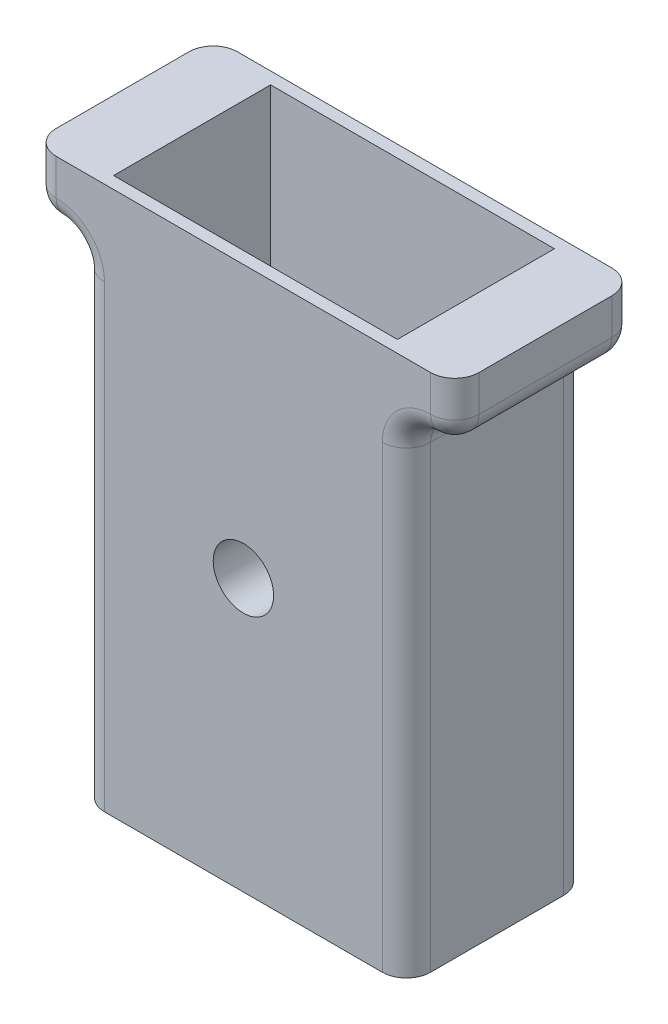
ISO-10303-21;
HEADER;
FILE_DESCRIPTION(('STEP AP214'),'2;1');
FILE_NAME('part.step','',(''),(''),'','','');
FILE_SCHEMA(('AUTOMOTIVE_DESIGN { 1 0 10303 214 1 1 1 1 }'));
ENDSEC;
DATA;
#1=APPLICATION_CONTEXT('core data for automotive mechanical design processes');
#2=APPLICATION_PROTOCOL_DEFINITION('international standard','automotive_design',2000,#1);
#3=PRODUCT_CONTEXT('',#1,'mechanical');
#4=PRODUCT('Part','Part','',(#3));
#5=PRODUCT_RELATED_PRODUCT_CATEGORY('part','',(#4));
#6=PRODUCT_DEFINITION_FORMATION('','',#4);
#7=PRODUCT_DEFINITION_CONTEXT('part definition',#1,'design');
#8=PRODUCT_DEFINITION('design','',#6,#7);
#9=PRODUCT_DEFINITION_SHAPE('','',#8);
#10=(LENGTH_UNIT() NAMED_UNIT(*) SI_UNIT(.MILLI.,.METRE.));
#11=(NAMED_UNIT(*) PLANE_ANGLE_UNIT() SI_UNIT($,.RADIAN.));
#12=(NAMED_UNIT(*) SI_UNIT($,.STERADIAN.) SOLID_ANGLE_UNIT());
#13=UNCERTAINTY_MEASURE_WITH_UNIT(LENGTH_MEASURE(1.E-05),#10,'distance_accuracy_value','');
#14=(GEOMETRIC_REPRESENTATION_CONTEXT(3) GLOBAL_UNCERTAINTY_ASSIGNED_CONTEXT((#13)) GLOBAL_UNIT_ASSIGNED_CONTEXT((#10,
#11,#12)) REPRESENTATION_CONTEXT('',''));
#15=CARTESIAN_POINT('',(0.,0.,0.));
#16=DIRECTION('',(0.,0.,1.));
#17=DIRECTION('',(1.,0.,0.));
#18=AXIS2_PLACEMENT_3D('',#15,#16,#17);
#19=CARTESIAN_POINT('',(13.5,22.5,2.));
#20=DIRECTION('',(0.,0.,-1.));
#21=DIRECTION('',(-1.,0.,0.));
#22=AXIS2_PLACEMENT_3D('',#19,#20,#21);
#23=CYLINDRICAL_SURFACE('',#22,2.5);
#24=CARTESIAN_POINT('',(13.5,22.5,0.));
#25=DIRECTION('',(0.,0.,-1.));
#26=DIRECTION('',(-1.,0.,0.));
#27=AXIS2_PLACEMENT_3D('',#24,#25,#26);
#28=CIRCLE('',#27,2.5);
#29=CARTESIAN_POINT('',(11.,22.5,0.));
#30=VERTEX_POINT('',#29);
#31=EDGE_CURVE('E178',#30,#30,#28,.T.);
#32=ORIENTED_EDGE('',*,*,#31,.F.);
#33=EDGE_LOOP('',(#32));
#34=FACE_BOUND('',#33,.T.);
#35=CARTESIAN_POINT('',(13.5,22.5,-10.));
#36=DIRECTION('',(0.,0.,-1.));
#37=DIRECTION('',(-1.,0.,0.));
#38=AXIS2_PLACEMENT_3D('',#35,#36,#37);
#39=CIRCLE('',#38,2.5);
#40=CARTESIAN_POINT('',(11.,22.5,-10.));
#41=VERTEX_POINT('',#40);
#42=EDGE_CURVE('E124',#41,#41,#39,.F.);
#43=ORIENTED_EDGE('',*,*,#42,.F.);
#44=EDGE_LOOP('',(#43));
#45=FACE_BOUND('',#44,.T.);
#46=ADVANCED_FACE('F37',(#34,#45),#23,.F.);
#47=CARTESIAN_POINT('',(0.,45.,0.));
#48=DIRECTION('',(1.,0.,0.));
#49=DIRECTION('',(0.,0.,-1.));
#50=AXIS2_PLACEMENT_3D('',#47,#48,#49);
#51=PLANE('',#50);
#52=DIRECTION('',(0.,0.,1.));
#53=VECTOR('',#52,1.);
#54=CARTESIAN_POINT('',(0.,28.,-11.75));
#55=LINE('',#54,#53);
#56=CARTESIAN_POINT('',(0.,28.,-11.75));
#57=VERTEX_POINT('',#56);
#58=CARTESIAN_POINT('',(0.,28.,-3.25));
#59=VERTEX_POINT('',#58);
#60=EDGE_CURVE('E457',#57,#59,#55,.T.);
#61=ORIENTED_EDGE('',*,*,#60,.F.);
#62=DIRECTION('',(0.,-1.,0.));
#63=VECTOR('',#62,1.);
#64=CARTESIAN_POINT('',(0.,31.5,-11.75));
#65=LINE('',#64,#63);
#66=CARTESIAN_POINT('',(0.,31.5,-11.75));
#67=VERTEX_POINT('',#66);
#68=EDGE_CURVE('E460',#67,#57,#65,.T.);
#69=ORIENTED_EDGE('',*,*,#68,.F.);
#70=DIRECTION('',(0.,0.,-1.));
#71=VECTOR('',#70,1.);
#72=CARTESIAN_POINT('',(0.,31.5,-11.75));
#73=LINE('',#72,#71);
#74=CARTESIAN_POINT('',(0.,31.5,-3.25));
#75=VERTEX_POINT('',#74);
#76=EDGE_CURVE('E444',#75,#67,#73,.T.);
#77=ORIENTED_EDGE('',*,*,#76,.F.);
#78=DIRECTION('',(0.,1.,0.));
#79=VECTOR('',#78,1.);
#80=CARTESIAN_POINT('',(0.,31.5,-3.25));
#81=LINE('',#80,#79);
#82=EDGE_CURVE('E454',#59,#75,#81,.T.);
#83=ORIENTED_EDGE('',*,*,#82,.F.);
#84=EDGE_LOOP('',(#61,#69,#77,#83));
#85=FACE_BOUND('',#84,.T.);
#86=DIRECTION('',(0.,0.,-1.));
#87=VECTOR('',#86,1.);
#88=CARTESIAN_POINT('',(0.,38.,0.));
#89=LINE('',#88,#87);
#90=CARTESIAN_POINT('',(0.,38.,-2.));
#91=VERTEX_POINT('',#90);
#92=CARTESIAN_POINT('',(0.,38.,-13.));
#93=VERTEX_POINT('',#92);
#94=EDGE_CURVE('E253',#91,#93,#89,.T.);
#95=ORIENTED_EDGE('',*,*,#94,.T.);
#96=DIRECTION('',(0.,-1.,0.));
#97=VECTOR('',#96,1.);
#98=CARTESIAN_POINT('',(0.,45.,-13.));
#99=LINE('',#98,#97);
#100=CARTESIAN_POINT('',(0.,0.,-13.));
#101=VERTEX_POINT('',#100);
#102=EDGE_CURVE('E256',#93,#101,#99,.T.);
#103=ORIENTED_EDGE('',*,*,#102,.T.);
#104=DIRECTION('',(0.,0.,1.));
#105=VECTOR('',#104,1.);
#106=CARTESIAN_POINT('',(0.,0.,0.));
#107=LINE('',#106,#105);
#108=CARTESIAN_POINT('',(0.,0.,-2.));
#109=VERTEX_POINT('',#108);
#110=EDGE_CURVE('E301',#101,#109,#107,.T.);
#111=ORIENTED_EDGE('',*,*,#110,.T.);
#112=DIRECTION('',(0.,-1.,0.));
#113=VECTOR('',#112,1.);
#114=CARTESIAN_POINT('',(0.,45.,-2.));
#115=LINE('',#114,#113);
#116=EDGE_CURVE('E250',#109,#91,#115,.F.);
#117=ORIENTED_EDGE('',*,*,#116,.T.);
#118=EDGE_LOOP('',(#95,#103,#111,#117));
#119=FACE_BOUND('',#118,.T.);
#120=ADVANCED_FACE('F487',(#85,#119),#51,.F.);
#121=CARTESIAN_POINT('',(0.,45.,0.));
#122=DIRECTION('',(0.,0.,-1.));
#123=DIRECTION('',(-1.,0.,0.));
#124=AXIS2_PLACEMENT_3D('',#121,#122,#123);
#125=PLANE('',#124);
#126=ORIENTED_EDGE('',*,*,#31,.T.);
#127=EDGE_LOOP('',(#126));
#128=FACE_BOUND('',#127,.T.);
#129=DIRECTION('',(1.,0.,0.));
#130=VECTOR('',#129,1.);
#131=CARTESIAN_POINT('',(0.,45.,0.));
#132=LINE('',#131,#130);
#133=CARTESIAN_POINT('',(-2.00000000000001,45.,0.));
#134=VERTEX_POINT('',#133);
#135=CARTESIAN_POINT('',(29.,45.,0.));
#136=VERTEX_POINT('',#135);
#137=EDGE_CURVE('E323',#134,#136,#132,.T.);
#138=ORIENTED_EDGE('',*,*,#137,.F.);
#139=DIRECTION('',(0.,1.,0.));
#140=VECTOR('',#139,1.);
#141=CARTESIAN_POINT('',(-2.00000000000001,40.,0.));
#142=LINE('',#141,#140);
#143=CARTESIAN_POINT('',(-2.,42.,0.));
#144=VERTEX_POINT('',#143);
#145=EDGE_CURVE('E217',#134,#144,#142,.F.);
#146=ORIENTED_EDGE('',*,*,#145,.T.);
#147=CARTESIAN_POINT('',(-2.,38.,0.));
#148=DIRECTION('',(0.,0.,-1.));
#149=DIRECTION('',(-1.,0.,0.));
#150=AXIS2_PLACEMENT_3D('',#147,#148,#149);
#151=CIRCLE('',#150,4.);
#152=CARTESIAN_POINT('',(2.,38.,0.));
#153=VERTEX_POINT('',#152);
#154=EDGE_CURVE('E314',#153,#144,#151,.F.);
#155=ORIENTED_EDGE('',*,*,#154,.F.);
#156=DIRECTION('',(0.,-1.,0.));
#157=VECTOR('',#156,1.);
#158=CARTESIAN_POINT('',(2.,45.,0.));
#159=LINE('',#158,#157);
#160=CARTESIAN_POINT('',(2.,0.,0.));
#161=VERTEX_POINT('',#160);
#162=EDGE_CURVE('E300',#153,#161,#159,.T.);
#163=ORIENTED_EDGE('',*,*,#162,.T.);
#164=DIRECTION('',(1.,0.,0.));
#165=VECTOR('',#164,1.);
#166=CARTESIAN_POINT('',(0.,0.,0.));
#167=LINE('',#166,#165);
#168=CARTESIAN_POINT('',(25.,0.,0.));
#169=VERTEX_POINT('',#168);
#170=EDGE_CURVE('E281',#161,#169,#167,.T.);
#171=ORIENTED_EDGE('',*,*,#170,.T.);
#172=DIRECTION('',(0.,-1.,0.));
#173=VECTOR('',#172,1.);
#174=CARTESIAN_POINT('',(25.,45.,0.));
#175=LINE('',#174,#173);
#176=CARTESIAN_POINT('',(25.,38.,0.));
#177=VERTEX_POINT('',#176);
#178=EDGE_CURVE('E297',#169,#177,#175,.F.);
#179=ORIENTED_EDGE('',*,*,#178,.T.);
#180=CARTESIAN_POINT('',(29.,38.,0.));
#181=DIRECTION('',(0.,0.,-1.));
#182=DIRECTION('',(-1.,0.,0.));
#183=AXIS2_PLACEMENT_3D('',#180,#181,#182);
#184=CIRCLE('',#183,4.);
#185=CARTESIAN_POINT('',(29.,42.,0.));
#186=VERTEX_POINT('',#185);
#187=EDGE_CURVE('E305',#186,#177,#184,.F.);
#188=ORIENTED_EDGE('',*,*,#187,.F.);
#189=DIRECTION('',(0.,1.,0.));
#190=VECTOR('',#189,1.);
#191=CARTESIAN_POINT('',(29.,45.,0.));
#192=LINE('',#191,#190);
#193=EDGE_CURVE('E304',#186,#136,#192,.T.);
#194=ORIENTED_EDGE('',*,*,#193,.T.);
#195=EDGE_LOOP('',(#138,#146,#155,#163,#171,#179,#188,#194));
#196=FACE_BOUND('',#195,.T.);
#197=ADVANCED_FACE('F294',(#128,#196),#125,.F.);
#198=CARTESIAN_POINT('',(27.,45.,0.));
#199=DIRECTION('',(-1.,0.,0.));
#200=DIRECTION('',(0.,0.,1.));
#201=AXIS2_PLACEMENT_3D('',#198,#199,#200);
#202=PLANE('',#201);
#203=DIRECTION('',(0.,0.,1.));
#204=VECTOR('',#203,1.);
#205=CARTESIAN_POINT('',(27.,38.,0.));
#206=LINE('',#205,#204);
#207=CARTESIAN_POINT('',(27.,38.,-13.));
#208=VERTEX_POINT('',#207);
#209=CARTESIAN_POINT('',(27.,38.,-2.));
#210=VERTEX_POINT('',#209);
#211=EDGE_CURVE('E262',#208,#210,#206,.T.);
#212=ORIENTED_EDGE('',*,*,#211,.T.);
#213=DIRECTION('',(0.,-1.,0.));
#214=VECTOR('',#213,1.);
#215=CARTESIAN_POINT('',(27.,45.,-2.));
#216=LINE('',#215,#214);
#217=CARTESIAN_POINT('',(27.,0.,-2.));
#218=VERTEX_POINT('',#217);
#219=EDGE_CURVE('E265',#210,#218,#216,.T.);
#220=ORIENTED_EDGE('',*,*,#219,.T.);
#221=DIRECTION('',(0.,0.,-1.));
#222=VECTOR('',#221,1.);
#223=CARTESIAN_POINT('',(27.,0.,0.));
#224=LINE('',#223,#222);
#225=CARTESIAN_POINT('',(27.,0.,-13.));
#226=VERTEX_POINT('',#225);
#227=EDGE_CURVE('E285',#218,#226,#224,.T.);
#228=ORIENTED_EDGE('',*,*,#227,.T.);
#229=DIRECTION('',(0.,-1.,0.));
#230=VECTOR('',#229,1.);
#231=CARTESIAN_POINT('',(27.,45.,-13.));
#232=LINE('',#231,#230);
#233=EDGE_CURVE('E259',#226,#208,#232,.F.);
#234=ORIENTED_EDGE('',*,*,#233,.T.);
#235=EDGE_LOOP('',(#212,#220,#228,#234));
#236=FACE_BOUND('',#235,.T.);
#237=ADVANCED_FACE('F360',(#236),#202,.F.);
#238=CARTESIAN_POINT('',(0.,45.,-15.));
#239=DIRECTION('',(0.,0.,1.));
#240=DIRECTION('',(1.,0.,0.));
#241=AXIS2_PLACEMENT_3D('',#238,#239,#240);
#242=PLANE('',#241);
#243=CARTESIAN_POINT('',(13.5,22.5,-15.));
#244=DIRECTION('',(0.,0.,-1.));
#245=DIRECTION('',(-1.,0.,0.));
#246=AXIS2_PLACEMENT_3D('',#243,#244,#245);
#247=CIRCLE('',#246,5.75);
#248=CARTESIAN_POINT('',(7.74999999999999,22.5,-15.));
#249=VERTEX_POINT('',#248);
#250=EDGE_CURVE('E468',#249,#249,#247,.T.);
#251=ORIENTED_EDGE('',*,*,#250,.F.);
#252=EDGE_LOOP('',(#251));
#253=FACE_BOUND('',#252,.T.);
#254=CARTESIAN_POINT('',(-2.00000000000001,38.,-15.));
#255=DIRECTION('',(0.,0.,1.));
#256=DIRECTION('',(1.,0.,0.));
#257=AXIS2_PLACEMENT_3D('',#254,#255,#256);
#258=CIRCLE('',#257,4.);
#259=CARTESIAN_POINT('',(-2.00000000000001,42.,-15.));
#260=VERTEX_POINT('',#259);
#261=CARTESIAN_POINT('',(1.99999999999999,38.,-15.));
#262=VERTEX_POINT('',#261);
#263=EDGE_CURVE('E215',#260,#262,#258,.F.);
#264=ORIENTED_EDGE('',*,*,#263,.F.);
#265=DIRECTION('',(0.,1.,0.));
#266=VECTOR('',#265,1.);
#267=CARTESIAN_POINT('',(-2.00000000000001,45.,-15.));
#268=LINE('',#267,#266);
#269=CARTESIAN_POINT('',(-2.00000000000001,45.,-15.));
#270=VERTEX_POINT('',#269);
#271=EDGE_CURVE('E226',#260,#270,#268,.T.);
#272=ORIENTED_EDGE('',*,*,#271,.T.);
#273=DIRECTION('',(-1.,0.,0.));
#274=VECTOR('',#273,1.);
#275=CARTESIAN_POINT('',(0.,45.,-15.));
#276=LINE('',#275,#274);
#277=CARTESIAN_POINT('',(29.,45.,-15.));
#278=VERTEX_POINT('',#277);
#279=EDGE_CURVE('E374',#278,#270,#276,.T.);
#280=ORIENTED_EDGE('',*,*,#279,.F.);
#281=DIRECTION('',(0.,1.,0.));
#282=VECTOR('',#281,1.);
#283=CARTESIAN_POINT('',(29.,40.,-15.));
#284=LINE('',#283,#282);
#285=CARTESIAN_POINT('',(29.,42.,-15.));
#286=VERTEX_POINT('',#285);
#287=EDGE_CURVE('E199',#278,#286,#284,.F.);
#288=ORIENTED_EDGE('',*,*,#287,.T.);
#289=CARTESIAN_POINT('',(29.,38.,-15.));
#290=DIRECTION('',(0.,0.,1.));
#291=DIRECTION('',(1.,0.,0.));
#292=AXIS2_PLACEMENT_3D('',#289,#290,#291);
#293=CIRCLE('',#292,4.);
#294=CARTESIAN_POINT('',(25.,38.,-15.));
#295=VERTEX_POINT('',#294);
#296=EDGE_CURVE('E207',#295,#286,#293,.F.);
#297=ORIENTED_EDGE('',*,*,#296,.F.);
#298=DIRECTION('',(0.,-1.,0.));
#299=VECTOR('',#298,1.);
#300=CARTESIAN_POINT('',(25.,45.,-15.));
#301=LINE('',#300,#299);
#302=CARTESIAN_POINT('',(25.,0.,-15.));
#303=VERTEX_POINT('',#302);
#304=EDGE_CURVE('E213',#295,#303,#301,.T.);
#305=ORIENTED_EDGE('',*,*,#304,.T.);
#306=DIRECTION('',(-1.,0.,0.));
#307=VECTOR('',#306,1.);
#308=CARTESIAN_POINT('',(0.,0.,-15.));
#309=LINE('',#308,#307);
#310=CARTESIAN_POINT('',(1.99999999999999,0.,-15.));
#311=VERTEX_POINT('',#310);
#312=EDGE_CURVE('E369',#303,#311,#309,.T.);
#313=ORIENTED_EDGE('',*,*,#312,.T.);
#314=DIRECTION('',(0.,-1.,0.));
#315=VECTOR('',#314,1.);
#316=CARTESIAN_POINT('',(1.99999999999999,45.,-15.));
#317=LINE('',#316,#315);
#318=EDGE_CURVE('E223',#311,#262,#317,.F.);
#319=ORIENTED_EDGE('',*,*,#318,.T.);
#320=EDGE_LOOP('',(#264,#272,#280,#288,#297,#305,#313,#319));
#321=FACE_BOUND('',#320,.T.);
#322=ADVANCED_FACE('F368',(#253,#321),#242,.F.);
#323=CARTESIAN_POINT('',(0.,45.,0.));
#324=DIRECTION('',(0.,-1.,0.));
#325=DIRECTION('',(0.,0.,-1.));
#326=AXIS2_PLACEMENT_3D('',#323,#324,#325);
#327=PLANE('',#326);
#328=DIRECTION('',(1.,0.,0.));
#329=VECTOR('',#328,1.);
#330=CARTESIAN_POINT('',(1.74999999999999,45.,-1.));
#331=LINE('',#330,#329);
#332=CARTESIAN_POINT('',(1.74999999999999,45.,-1.));
#333=VERTEX_POINT('',#332);
#334=CARTESIAN_POINT('',(25.25,45.,-0.999999999999996));
#335=VERTEX_POINT('',#334);
#336=EDGE_CURVE('E417',#333,#335,#331,.T.);
#337=ORIENTED_EDGE('',*,*,#336,.F.);
#338=DIRECTION('',(0.,0.,1.));
#339=VECTOR('',#338,1.);
#340=CARTESIAN_POINT('',(1.74999999999999,45.,-14.));
#341=LINE('',#340,#339);
#342=CARTESIAN_POINT('',(1.74999999999999,45.,-14.));
#343=VERTEX_POINT('',#342);
#344=EDGE_CURVE('E420',#343,#333,#341,.T.);
#345=ORIENTED_EDGE('',*,*,#344,.F.);
#346=DIRECTION('',(-1.,0.,0.));
#347=VECTOR('',#346,1.);
#348=CARTESIAN_POINT('',(1.74999999999999,45.,-14.));
#349=LINE('',#348,#347);
#350=CARTESIAN_POINT('',(25.25,45.,-14.));
#351=VERTEX_POINT('',#350);
#352=EDGE_CURVE('E410',#351,#343,#349,.T.);
#353=ORIENTED_EDGE('',*,*,#352,.F.);
#354=DIRECTION('',(0.,0.,-1.));
#355=VECTOR('',#354,1.);
#356=CARTESIAN_POINT('',(25.25,45.,-14.));
#357=LINE('',#356,#355);
#358=EDGE_CURVE('E414',#335,#351,#357,.T.);
#359=ORIENTED_EDGE('',*,*,#358,.F.);
#360=EDGE_LOOP('',(#337,#345,#353,#359));
#361=FACE_BOUND('',#360,.T.);
#362=ORIENTED_EDGE('',*,*,#279,.T.);
#363=CARTESIAN_POINT('',(-2.00000000000001,45.,-13.));
#364=DIRECTION('',(0.,-1.,0.));
#365=DIRECTION('',(0.,0.,-1.));
#366=AXIS2_PLACEMENT_3D('',#363,#364,#365);
#367=CIRCLE('',#366,2.);
#368=CARTESIAN_POINT('',(-4.00000000000001,45.,-13.));
#369=VERTEX_POINT('',#368);
#370=EDGE_CURVE('E238',#270,#369,#367,.F.);
#371=ORIENTED_EDGE('',*,*,#370,.T.);
#372=DIRECTION('',(0.,0.,1.));
#373=VECTOR('',#372,1.);
#374=CARTESIAN_POINT('',(-4.00000000000001,45.,0.));
#375=LINE('',#374,#373);
#376=CARTESIAN_POINT('',(-4.00000000000001,45.,-2.));
#377=VERTEX_POINT('',#376);
#378=EDGE_CURVE('E392',#369,#377,#375,.T.);
#379=ORIENTED_EDGE('',*,*,#378,.T.);
#380=CARTESIAN_POINT('',(-2.00000000000001,45.,-2.));
#381=DIRECTION('',(0.,-1.,0.));
#382=DIRECTION('',(0.,0.,-1.));
#383=AXIS2_PLACEMENT_3D('',#380,#381,#382);
#384=CIRCLE('',#383,2.);
#385=EDGE_CURVE('E235',#377,#134,#384,.F.);
#386=ORIENTED_EDGE('',*,*,#385,.T.);
#387=ORIENTED_EDGE('',*,*,#137,.T.);
#388=CARTESIAN_POINT('',(29.,45.,-2.));
#389=DIRECTION('',(0.,-1.,0.));
#390=DIRECTION('',(0.,0.,-1.));
#391=AXIS2_PLACEMENT_3D('',#388,#389,#390);
#392=CIRCLE('',#391,2.);
#393=CARTESIAN_POINT('',(31.,45.,-2.));
#394=VERTEX_POINT('',#393);
#395=EDGE_CURVE('E232',#136,#394,#392,.F.);
#396=ORIENTED_EDGE('',*,*,#395,.T.);
#397=DIRECTION('',(0.,0.,-1.));
#398=VECTOR('',#397,1.);
#399=CARTESIAN_POINT('',(31.,45.,0.));
#400=LINE('',#399,#398);
#401=CARTESIAN_POINT('',(31.,45.,-13.));
#402=VERTEX_POINT('',#401);
#403=EDGE_CURVE('E390',#394,#402,#400,.T.);
#404=ORIENTED_EDGE('',*,*,#403,.T.);
#405=CARTESIAN_POINT('',(29.,45.,-13.));
#406=DIRECTION('',(0.,-1.,0.));
#407=DIRECTION('',(0.,0.,-1.));
#408=AXIS2_PLACEMENT_3D('',#405,#406,#407);
#409=CIRCLE('',#408,2.);
#410=EDGE_CURVE('E229',#402,#278,#409,.F.);
#411=ORIENTED_EDGE('',*,*,#410,.T.);
#412=EDGE_LOOP('',(#362,#371,#379,#386,#387,#396,#404,#411));
#413=FACE_BOUND('',#412,.T.);
#414=ADVANCED_FACE('F476',(#361,#413),#327,.F.);
#415=CARTESIAN_POINT('',(0.,0.,0.));
#416=DIRECTION('',(0.,-1.,0.));
#417=DIRECTION('',(0.,0.,-1.));
#418=AXIS2_PLACEMENT_3D('',#415,#416,#417);
#419=PLANE('',#418);
#420=ORIENTED_EDGE('',*,*,#110,.F.);
#421=CARTESIAN_POINT('',(1.99999999999999,0.,-13.));
#422=DIRECTION('',(0.,-1.,0.));
#423=DIRECTION('',(0.,0.,-1.));
#424=AXIS2_PLACEMENT_3D('',#421,#422,#423);
#425=CIRCLE('',#424,2.);
#426=EDGE_CURVE('E127',#101,#311,#425,.T.);
#427=ORIENTED_EDGE('',*,*,#426,.T.);
#428=ORIENTED_EDGE('',*,*,#312,.F.);
#429=CARTESIAN_POINT('',(25.,0.,-13.));
#430=DIRECTION('',(0.,-1.,0.));
#431=DIRECTION('',(0.,0.,-1.));
#432=AXIS2_PLACEMENT_3D('',#429,#430,#431);
#433=CIRCLE('',#432,2.);
#434=EDGE_CURVE('E271',#303,#226,#433,.T.);
#435=ORIENTED_EDGE('',*,*,#434,.T.);
#436=ORIENTED_EDGE('',*,*,#227,.F.);
#437=CARTESIAN_POINT('',(25.,0.,-2.));
#438=DIRECTION('',(0.,-1.,0.));
#439=DIRECTION('',(0.,0.,-1.));
#440=AXIS2_PLACEMENT_3D('',#437,#438,#439);
#441=CIRCLE('',#440,2.);
#442=EDGE_CURVE('E142',#218,#169,#441,.T.);
#443=ORIENTED_EDGE('',*,*,#442,.T.);
#444=ORIENTED_EDGE('',*,*,#170,.F.);
#445=CARTESIAN_POINT('',(2.,0.,-2.));
#446=DIRECTION('',(0.,-1.,0.));
#447=DIRECTION('',(0.,0.,-1.));
#448=AXIS2_PLACEMENT_3D('',#445,#446,#447);
#449=CIRCLE('',#448,2.);
#450=EDGE_CURVE('E133',#161,#109,#449,.T.);
#451=ORIENTED_EDGE('',*,*,#450,.T.);
#452=EDGE_LOOP('',(#420,#427,#428,#435,#436,#443,#444,#451));
#453=FACE_BOUND('',#452,.T.);
#454=ADVANCED_FACE('F279',(#453),#419,.T.);
#455=CARTESIAN_POINT('',(31.,40.,0.));
#456=DIRECTION('',(1.,0.,0.));
#457=DIRECTION('',(0.,0.,-1.));
#458=AXIS2_PLACEMENT_3D('',#455,#456,#457);
#459=PLANE('',#458);
#460=ORIENTED_EDGE('',*,*,#403,.F.);
#461=DIRECTION('',(0.,1.,0.));
#462=VECTOR('',#461,1.);
#463=CARTESIAN_POINT('',(31.,40.,-2.));
#464=LINE('',#463,#462);
#465=CARTESIAN_POINT('',(31.,42.,-2.));
#466=VERTEX_POINT('',#465);
#467=EDGE_CURVE('E60',#394,#466,#464,.F.);
#468=ORIENTED_EDGE('',*,*,#467,.T.);
#469=DIRECTION('',(0.,0.,-1.));
#470=VECTOR('',#469,1.);
#471=CARTESIAN_POINT('',(31.,42.,0.));
#472=LINE('',#471,#470);
#473=CARTESIAN_POINT('',(31.,42.,-13.));
#474=VERTEX_POINT('',#473);
#475=EDGE_CURVE('E100',#466,#474,#472,.T.);
#476=ORIENTED_EDGE('',*,*,#475,.T.);
#477=DIRECTION('',(0.,1.,0.));
#478=VECTOR('',#477,1.);
#479=CARTESIAN_POINT('',(31.,45.,-13.));
#480=LINE('',#479,#478);
#481=EDGE_CURVE('E201',#474,#402,#480,.T.);
#482=ORIENTED_EDGE('',*,*,#481,.T.);
#483=EDGE_LOOP('',(#460,#468,#476,#482));
#484=FACE_BOUND('',#483,.T.);
#485=ADVANCED_FACE('F533',(#484),#459,.T.);
#486=CARTESIAN_POINT('',(-4.00000000000001,40.,0.));
#487=DIRECTION('',(-1.,0.,0.));
#488=DIRECTION('',(0.,0.,1.));
#489=AXIS2_PLACEMENT_3D('',#486,#487,#488);
#490=PLANE('',#489);
#491=ORIENTED_EDGE('',*,*,#378,.F.);
#492=DIRECTION('',(0.,1.,0.));
#493=VECTOR('',#492,1.);
#494=CARTESIAN_POINT('',(-4.00000000000001,40.,-13.));
#495=LINE('',#494,#493);
#496=CARTESIAN_POINT('',(-4.00000000000001,42.,-13.));
#497=VERTEX_POINT('',#496);
#498=EDGE_CURVE('E247',#369,#497,#495,.F.);
#499=ORIENTED_EDGE('',*,*,#498,.T.);
#500=DIRECTION('',(0.,0.,1.));
#501=VECTOR('',#500,1.);
#502=CARTESIAN_POINT('',(-4.00000000000001,42.,0.));
#503=LINE('',#502,#501);
#504=CARTESIAN_POINT('',(-4.00000000000001,42.,-2.));
#505=VERTEX_POINT('',#504);
#506=EDGE_CURVE('E241',#497,#505,#503,.T.);
#507=ORIENTED_EDGE('',*,*,#506,.T.);
#508=DIRECTION('',(0.,1.,0.));
#509=VECTOR('',#508,1.);
#510=CARTESIAN_POINT('',(-4.00000000000001,45.,-2.));
#511=LINE('',#510,#509);
#512=EDGE_CURVE('E244',#505,#377,#511,.T.);
#513=ORIENTED_EDGE('',*,*,#512,.T.);
#514=EDGE_LOOP('',(#491,#499,#507,#513));
#515=FACE_BOUND('',#514,.T.);
#516=ADVANCED_FACE('F532',(#515),#490,.T.);
#517=CARTESIAN_POINT('',(1.74999999999999,28.,-14.));
#518=DIRECTION('',(-1.,0.,0.));
#519=DIRECTION('',(0.,0.,1.));
#520=AXIS2_PLACEMENT_3D('',#517,#518,#519);
#521=PLANE('',#520);
#522=DIRECTION('',(0.,0.,-1.));
#523=VECTOR('',#522,1.);
#524=CARTESIAN_POINT('',(1.74999999999999,31.5,-14.));
#525=LINE('',#524,#523);
#526=CARTESIAN_POINT('',(1.74999999999999,31.5,-3.25));
#527=VERTEX_POINT('',#526);
#528=CARTESIAN_POINT('',(1.74999999999999,31.5,-11.75));
#529=VERTEX_POINT('',#528);
#530=EDGE_CURVE('E309',#527,#529,#525,.T.);
#531=ORIENTED_EDGE('',*,*,#530,.T.);
#532=DIRECTION('',(0.,-1.,0.));
#533=VECTOR('',#532,1.);
#534=CARTESIAN_POINT('',(1.74999999999999,28.,-11.75));
#535=LINE('',#534,#533);
#536=CARTESIAN_POINT('',(1.74999999999999,28.,-11.75));
#537=VERTEX_POINT('',#536);
#538=EDGE_CURVE('E423',#529,#537,#535,.T.);
#539=ORIENTED_EDGE('',*,*,#538,.T.);
#540=DIRECTION('',(0.,0.,1.));
#541=VECTOR('',#540,1.);
#542=CARTESIAN_POINT('',(1.74999999999999,28.,-14.));
#543=LINE('',#542,#541);
#544=CARTESIAN_POINT('',(1.74999999999999,28.,-14.));
#545=VERTEX_POINT('',#544);
#546=EDGE_CURVE('E433',#545,#537,#543,.T.);
#547=ORIENTED_EDGE('',*,*,#546,.F.);
#548=DIRECTION('',(0.,1.,0.));
#549=VECTOR('',#548,1.);
#550=CARTESIAN_POINT('',(1.74999999999999,28.,-14.));
#551=LINE('',#550,#549);
#552=EDGE_CURVE('E395',#545,#343,#551,.T.);
#553=ORIENTED_EDGE('',*,*,#552,.T.);
#554=ORIENTED_EDGE('',*,*,#344,.T.);
#555=DIRECTION('',(0.,1.,0.));
#556=VECTOR('',#555,1.);
#557=CARTESIAN_POINT('',(1.74999999999999,28.,-1.));
#558=LINE('',#557,#556);
#559=CARTESIAN_POINT('',(1.74999999999999,28.,-1.));
#560=VERTEX_POINT('',#559);
#561=EDGE_CURVE('E398',#560,#333,#558,.T.);
#562=ORIENTED_EDGE('',*,*,#561,.F.);
#563=CARTESIAN_POINT('',(1.74999999999999,28.,-3.25));
#564=VERTEX_POINT('',#563);
#565=EDGE_CURVE('E413',#564,#560,#543,.T.);
#566=ORIENTED_EDGE('',*,*,#565,.F.);
#567=DIRECTION('',(0.,1.,0.));
#568=VECTOR('',#567,1.);
#569=CARTESIAN_POINT('',(1.74999999999999,28.,-3.25));
#570=LINE('',#569,#568);
#571=EDGE_CURVE('E437',#564,#527,#570,.T.);
#572=ORIENTED_EDGE('',*,*,#571,.T.);
#573=EDGE_LOOP('',(#531,#539,#547,#553,#554,#562,#566,#572));
#574=FACE_BOUND('',#573,.T.);
#575=ADVANCED_FACE('F522',(#574),#521,.F.);
#576=CARTESIAN_POINT('',(1.74999999999999,28.,-14.));
#577=DIRECTION('',(0.,0.,-1.));
#578=DIRECTION('',(-1.,0.,0.));
#579=AXIS2_PLACEMENT_3D('',#576,#577,#578);
#580=PLANE('',#579);
#581=DIRECTION('',(-1.,0.,0.));
#582=VECTOR('',#581,1.);
#583=CARTESIAN_POINT('',(1.74999999999999,28.,-14.));
#584=LINE('',#583,#582);
#585=CARTESIAN_POINT('',(11.8229490168751,28.,-14.));
#586=VERTEX_POINT('',#585);
#587=EDGE_CURVE('E426',#586,#545,#584,.T.);
#588=ORIENTED_EDGE('',*,*,#587,.F.);
#589=CARTESIAN_POINT('',(13.5,22.5,-14.));
#590=DIRECTION('',(0.,0.,-1.));
#591=DIRECTION('',(-1.,0.,0.));
#592=AXIS2_PLACEMENT_3D('',#589,#590,#591);
#593=CIRCLE('',#592,5.75);
#594=CARTESIAN_POINT('',(15.1770509831248,28.,-14.));
#595=VERTEX_POINT('',#594);
#596=EDGE_CURVE('E181',#586,#595,#593,.T.);
#597=ORIENTED_EDGE('',*,*,#596,.T.);
#598=CARTESIAN_POINT('',(25.25,28.,-14.));
#599=VERTEX_POINT('',#598);
#600=EDGE_CURVE('E402',#599,#595,#584,.T.);
#601=ORIENTED_EDGE('',*,*,#600,.F.);
#602=DIRECTION('',(0.,1.,0.));
#603=VECTOR('',#602,1.);
#604=CARTESIAN_POINT('',(25.25,28.,-14.));
#605=LINE('',#604,#603);
#606=EDGE_CURVE('E405',#599,#351,#605,.T.);
#607=ORIENTED_EDGE('',*,*,#606,.T.);
#608=ORIENTED_EDGE('',*,*,#352,.T.);
#609=ORIENTED_EDGE('',*,*,#552,.F.);
#610=EDGE_LOOP('',(#588,#597,#601,#607,#608,#609));
#611=FACE_BOUND('',#610,.T.);
#612=ADVANCED_FACE('F518',(#611),#580,.F.);
#613=CARTESIAN_POINT('',(25.25,28.,-14.));
#614=DIRECTION('',(1.,0.,0.));
#615=DIRECTION('',(0.,0.,-1.));
#616=AXIS2_PLACEMENT_3D('',#613,#614,#615);
#617=PLANE('',#616);
#618=ORIENTED_EDGE('',*,*,#358,.T.);
#619=ORIENTED_EDGE('',*,*,#606,.F.);
#620=DIRECTION('',(0.,0.,-1.));
#621=VECTOR('',#620,1.);
#622=CARTESIAN_POINT('',(25.25,28.,-14.));
#623=LINE('',#622,#621);
#624=CARTESIAN_POINT('',(25.25,28.,-0.999999999999996));
#625=VERTEX_POINT('',#624);
#626=EDGE_CURVE('E427',#625,#599,#623,.T.);
#627=ORIENTED_EDGE('',*,*,#626,.F.);
#628=DIRECTION('',(0.,1.,0.));
#629=VECTOR('',#628,1.);
#630=CARTESIAN_POINT('',(25.25,28.,-0.999999999999996));
#631=LINE('',#630,#629);
#632=EDGE_CURVE('E401',#625,#335,#631,.T.);
#633=ORIENTED_EDGE('',*,*,#632,.T.);
#634=EDGE_LOOP('',(#618,#619,#627,#633));
#635=FACE_BOUND('',#634,.T.);
#636=ADVANCED_FACE('F521',(#635),#617,.F.);
#637=CARTESIAN_POINT('',(1.74999999999999,28.,-1.));
#638=DIRECTION('',(0.,0.,1.));
#639=DIRECTION('',(1.,0.,0.));
#640=AXIS2_PLACEMENT_3D('',#637,#638,#639);
#641=PLANE('',#640);
#642=ORIENTED_EDGE('',*,*,#336,.T.);
#643=ORIENTED_EDGE('',*,*,#632,.F.);
#644=DIRECTION('',(1.,0.,0.));
#645=VECTOR('',#644,1.);
#646=CARTESIAN_POINT('',(1.74999999999999,28.,-1.));
#647=LINE('',#646,#645);
#648=EDGE_CURVE('E430',#560,#625,#647,.T.);
#649=ORIENTED_EDGE('',*,*,#648,.F.);
#650=ORIENTED_EDGE('',*,*,#561,.T.);
#651=EDGE_LOOP('',(#642,#643,#649,#650));
#652=FACE_BOUND('',#651,.T.);
#653=ADVANCED_FACE('F516',(#652),#641,.F.);
#654=CARTESIAN_POINT('',(0.,28.,0.));
#655=DIRECTION('',(0.,1.,0.));
#656=DIRECTION('',(0.,0.,1.));
#657=AXIS2_PLACEMENT_3D('',#654,#655,#656);
#658=PLANE('',#657);
#659=DIRECTION('',(0.,0.,-1.));
#660=VECTOR('',#659,1.);
#661=CARTESIAN_POINT('',(15.1770509831248,28.,-10.));
#662=LINE('',#661,#660);
#663=CARTESIAN_POINT('',(15.1770509831248,28.,-10.));
#664=VERTEX_POINT('',#663);
#665=EDGE_CURVE('E11',#664,#595,#662,.T.);
#666=ORIENTED_EDGE('',*,*,#665,.F.);
#667=DIRECTION('',(-1.,0.,0.));
#668=VECTOR('',#667,1.);
#669=CARTESIAN_POINT('',(0.,28.,-10.));
#670=LINE('',#669,#668);
#671=CARTESIAN_POINT('',(11.8229490168751,28.,-10.));
#672=VERTEX_POINT('',#671);
#673=EDGE_CURVE('E126',#664,#672,#670,.T.);
#674=ORIENTED_EDGE('',*,*,#673,.T.);
#675=DIRECTION('',(0.,0.,-1.));
#676=VECTOR('',#675,1.);
#677=CARTESIAN_POINT('',(11.8229490168751,28.,-10.));
#678=LINE('',#677,#676);
#679=EDGE_CURVE('E45',#586,#672,#678,.F.);
#680=ORIENTED_EDGE('',*,*,#679,.F.);
#681=ORIENTED_EDGE('',*,*,#587,.T.);
#682=ORIENTED_EDGE('',*,*,#546,.T.);
#683=DIRECTION('',(-1.,0.,0.));
#684=VECTOR('',#683,1.);
#685=CARTESIAN_POINT('',(17.,28.,-11.75));
#686=LINE('',#685,#684);
#687=EDGE_CURVE('E440',#537,#57,#686,.T.);
#688=ORIENTED_EDGE('',*,*,#687,.T.);
#689=ORIENTED_EDGE('',*,*,#60,.T.);
#690=DIRECTION('',(-1.,0.,0.));
#691=VECTOR('',#690,1.);
#692=CARTESIAN_POINT('',(17.,28.,-3.25000000000001));
#693=LINE('',#692,#691);
#694=EDGE_CURVE('E443',#564,#59,#693,.T.);
#695=ORIENTED_EDGE('',*,*,#694,.F.);
#696=ORIENTED_EDGE('',*,*,#565,.T.);
#697=ORIENTED_EDGE('',*,*,#648,.T.);
#698=ORIENTED_EDGE('',*,*,#626,.T.);
#699=ORIENTED_EDGE('',*,*,#600,.T.);
#700=EDGE_LOOP('',(#666,#674,#680,#681,#682,#688,#689,#695,#696,#697,#698,#699));
#701=FACE_BOUND('',#700,.T.);
#702=ADVANCED_FACE('F504',(#701),#658,.T.);
#703=CARTESIAN_POINT('',(17.,31.5,-11.75));
#704=DIRECTION('',(0.,1.,0.));
#705=DIRECTION('',(0.,0.,1.));
#706=AXIS2_PLACEMENT_3D('',#703,#704,#705);
#707=PLANE('',#706);
#708=DIRECTION('',(-1.,0.,0.));
#709=VECTOR('',#708,1.);
#710=CARTESIAN_POINT('',(17.,31.5,-3.25000000000001));
#711=LINE('',#710,#709);
#712=EDGE_CURVE('E447',#527,#75,#711,.T.);
#713=ORIENTED_EDGE('',*,*,#712,.T.);
#714=ORIENTED_EDGE('',*,*,#76,.T.);
#715=DIRECTION('',(-1.,0.,0.));
#716=VECTOR('',#715,1.);
#717=CARTESIAN_POINT('',(17.,31.5,-11.75));
#718=LINE('',#717,#716);
#719=EDGE_CURVE('E439',#529,#67,#718,.T.);
#720=ORIENTED_EDGE('',*,*,#719,.F.);
#721=ORIENTED_EDGE('',*,*,#530,.F.);
#722=EDGE_LOOP('',(#713,#714,#720,#721));
#723=FACE_BOUND('',#722,.T.);
#724=ADVANCED_FACE('F500',(#723),#707,.F.);
#725=CARTESIAN_POINT('',(17.,31.5,-11.75));
#726=DIRECTION('',(0.,0.,-1.));
#727=DIRECTION('',(-1.,0.,0.));
#728=AXIS2_PLACEMENT_3D('',#725,#726,#727);
#729=PLANE('',#728);
#730=ORIENTED_EDGE('',*,*,#719,.T.);
#731=ORIENTED_EDGE('',*,*,#68,.T.);
#732=ORIENTED_EDGE('',*,*,#687,.F.);
#733=ORIENTED_EDGE('',*,*,#538,.F.);
#734=EDGE_LOOP('',(#730,#731,#732,#733));
#735=FACE_BOUND('',#734,.T.);
#736=ADVANCED_FACE('F503',(#735),#729,.F.);
#737=CARTESIAN_POINT('',(17.,31.5,-3.25000000000001));
#738=DIRECTION('',(0.,0.,1.));
#739=DIRECTION('',(1.,0.,0.));
#740=AXIS2_PLACEMENT_3D('',#737,#738,#739);
#741=PLANE('',#740);
#742=ORIENTED_EDGE('',*,*,#694,.T.);
#743=ORIENTED_EDGE('',*,*,#82,.T.);
#744=ORIENTED_EDGE('',*,*,#712,.F.);
#745=ORIENTED_EDGE('',*,*,#571,.F.);
#746=EDGE_LOOP('',(#742,#743,#744,#745));
#747=FACE_BOUND('',#746,.T.);
#748=ADVANCED_FACE('F506',(#747),#741,.F.);
#749=CARTESIAN_POINT('',(-2.00000000000001,45.,-13.));
#750=DIRECTION('',(0.,-1.,0.));
#751=DIRECTION('',(0.,0.,-1.));
#752=AXIS2_PLACEMENT_3D('',#749,#750,#751);
#753=CYLINDRICAL_SURFACE('',#752,2.);
#754=ORIENTED_EDGE('',*,*,#370,.F.);
#755=ORIENTED_EDGE('',*,*,#271,.F.);
#756=CARTESIAN_POINT('',(-2.00000000000001,42.,-13.));
#757=DIRECTION('',(0.,-1.,0.));
#758=DIRECTION('',(0.,0.,-1.));
#759=AXIS2_PLACEMENT_3D('',#756,#757,#758);
#760=CIRCLE('',#759,2.);
#761=EDGE_CURVE('E175',#497,#260,#760,.T.);
#762=ORIENTED_EDGE('',*,*,#761,.F.);
#763=ORIENTED_EDGE('',*,*,#498,.F.);
#764=EDGE_LOOP('',(#754,#755,#762,#763));
#765=FACE_BOUND('',#764,.T.);
#766=ADVANCED_FACE('F509',(#765),#753,.T.);
#767=CARTESIAN_POINT('',(1.99999999999999,45.,-13.));
#768=DIRECTION('',(0.,-1.,0.));
#769=DIRECTION('',(0.,0.,-1.));
#770=AXIS2_PLACEMENT_3D('',#767,#768,#769);
#771=CYLINDRICAL_SURFACE('',#770,2.);
#772=ORIENTED_EDGE('',*,*,#426,.F.);
#773=ORIENTED_EDGE('',*,*,#102,.F.);
#774=CARTESIAN_POINT('',(1.99999999999999,38.,-13.));
#775=DIRECTION('',(0.,1.,0.));
#776=DIRECTION('',(0.,0.,1.));
#777=AXIS2_PLACEMENT_3D('',#774,#775,#776);
#778=CIRCLE('',#777,2.);
#779=EDGE_CURVE('E172',#262,#93,#778,.T.);
#780=ORIENTED_EDGE('',*,*,#779,.F.);
#781=ORIENTED_EDGE('',*,*,#318,.F.);
#782=EDGE_LOOP('',(#772,#773,#780,#781));
#783=FACE_BOUND('',#782,.T.);
#784=ADVANCED_FACE('F591',(#783),#771,.T.);
#785=CARTESIAN_POINT('',(-2.00000000000001,42.,-13.));
#786=DIRECTION('',(0.,0.,-1.));
#787=DIRECTION('',(-1.,0.,0.));
#788=AXIS2_PLACEMENT_3D('',#785,#786,#787);
#789=SPHERICAL_SURFACE('',#788,2.);
#790=ORIENTED_EDGE('',*,*,#761,.T.);
#791=CARTESIAN_POINT('',(-2.00000000000001,42.,-13.));
#792=DIRECTION('',(1.,0.,0.));
#793=DIRECTION('',(0.,0.,-1.));
#794=AXIS2_PLACEMENT_3D('',#791,#792,#793);
#795=CIRCLE('',#794,2.);
#796=CARTESIAN_POINT('',(-2.00000000000001,40.,-13.));
#797=VERTEX_POINT('',#796);
#798=EDGE_CURVE('E169',#797,#260,#795,.T.);
#799=ORIENTED_EDGE('',*,*,#798,.F.);
#800=CARTESIAN_POINT('',(-2.00000000000001,42.,-13.));
#801=DIRECTION('',(0.,0.,-1.));
#802=DIRECTION('',(-1.,0.,0.));
#803=AXIS2_PLACEMENT_3D('',#800,#801,#802);
#804=CIRCLE('',#803,2.);
#805=EDGE_CURVE('E166',#497,#797,#804,.F.);
#806=ORIENTED_EDGE('',*,*,#805,.F.);
#807=EDGE_LOOP('',(#790,#799,#806));
#808=FACE_BOUND('',#807,.T.);
#809=ADVANCED_FACE('F599',(#808),#789,.T.);
#810=CARTESIAN_POINT('',(-2.00000000000001,38.,-13.));
#811=DIRECTION('',(0.,0.,1.));
#812=DIRECTION('',(1.,0.,0.));
#813=AXIS2_PLACEMENT_3D('',#810,#811,#812);
#814=TOROIDAL_SURFACE('',#813,4.,2.);
#815=ORIENTED_EDGE('',*,*,#263,.T.);
#816=ORIENTED_EDGE('',*,*,#779,.T.);
#817=CARTESIAN_POINT('',(-2.00000000000001,38.,-13.));
#818=DIRECTION('',(0.,0.,1.));
#819=DIRECTION('',(1.,0.,0.));
#820=AXIS2_PLACEMENT_3D('',#817,#818,#819);
#821=CIRCLE('',#820,2.);
#822=EDGE_CURVE('E163',#797,#93,#821,.F.);
#823=ORIENTED_EDGE('',*,*,#822,.F.);
#824=ORIENTED_EDGE('',*,*,#798,.T.);
#825=EDGE_LOOP('',(#815,#816,#823,#824));
#826=FACE_BOUND('',#825,.T.);
#827=ADVANCED_FACE('F607',(#826),#814,.T.);
#828=CARTESIAN_POINT('',(-2.00000000000001,42.,0.));
#829=DIRECTION('',(0.,0.,1.));
#830=DIRECTION('',(1.,0.,0.));
#831=AXIS2_PLACEMENT_3D('',#828,#829,#830);
#832=CYLINDRICAL_SURFACE('',#831,2.);
#833=ORIENTED_EDGE('',*,*,#506,.F.);
#834=ORIENTED_EDGE('',*,*,#805,.T.);
#835=DIRECTION('',(0.,0.,1.));
#836=VECTOR('',#835,1.);
#837=CARTESIAN_POINT('',(-2.00000000000001,40.,0.));
#838=LINE('',#837,#836);
#839=CARTESIAN_POINT('',(-2.00000000000001,40.,-2.));
#840=VERTEX_POINT('',#839);
#841=EDGE_CURVE('E160',#840,#797,#838,.F.);
#842=ORIENTED_EDGE('',*,*,#841,.F.);
#843=CARTESIAN_POINT('',(-2.00000000000001,42.,-2.));
#844=DIRECTION('',(0.,0.,1.));
#845=DIRECTION('',(1.,0.,0.));
#846=AXIS2_PLACEMENT_3D('',#843,#844,#845);
#847=CIRCLE('',#846,2.);
#848=EDGE_CURVE('E157',#505,#840,#847,.T.);
#849=ORIENTED_EDGE('',*,*,#848,.F.);
#850=EDGE_LOOP('',(#833,#834,#842,#849));
#851=FACE_BOUND('',#850,.T.);
#852=ADVANCED_FACE('F615',(#851),#832,.T.);
#853=CARTESIAN_POINT('',(-2.00000000000001,40.,-2.));
#854=DIRECTION('',(0.,-1.,0.));
#855=DIRECTION('',(0.,0.,-1.));
#856=AXIS2_PLACEMENT_3D('',#853,#854,#855);
#857=CYLINDRICAL_SURFACE('',#856,2.);
#858=ORIENTED_EDGE('',*,*,#385,.F.);
#859=ORIENTED_EDGE('',*,*,#512,.F.);
#860=CARTESIAN_POINT('',(-2.00000000000001,42.,-2.));
#861=DIRECTION('',(0.,-1.,0.));
#862=DIRECTION('',(0.,0.,-1.));
#863=AXIS2_PLACEMENT_3D('',#860,#861,#862);
#864=CIRCLE('',#863,2.);
#865=EDGE_CURVE('E154',#144,#505,#864,.T.);
#866=ORIENTED_EDGE('',*,*,#865,.F.);
#867=ORIENTED_EDGE('',*,*,#145,.F.);
#868=EDGE_LOOP('',(#858,#859,#866,#867));
#869=FACE_BOUND('',#868,.T.);
#870=ADVANCED_FACE('F328',(#869),#857,.T.);
#871=CARTESIAN_POINT('',(2.,45.,-2.));
#872=DIRECTION('',(0.,-1.,0.));
#873=DIRECTION('',(0.,0.,-1.));
#874=AXIS2_PLACEMENT_3D('',#871,#872,#873);
#875=CYLINDRICAL_SURFACE('',#874,2.);
#876=ORIENTED_EDGE('',*,*,#450,.F.);
#877=ORIENTED_EDGE('',*,*,#162,.F.);
#878=CARTESIAN_POINT('',(2.,38.,-2.));
#879=DIRECTION('',(0.,1.,0.));
#880=DIRECTION('',(0.,0.,1.));
#881=AXIS2_PLACEMENT_3D('',#878,#879,#880);
#882=CIRCLE('',#881,2.);
#883=EDGE_CURVE('E151',#91,#153,#882,.T.);
#884=ORIENTED_EDGE('',*,*,#883,.F.);
#885=ORIENTED_EDGE('',*,*,#116,.F.);
#886=EDGE_LOOP('',(#876,#877,#884,#885));
#887=FACE_BOUND('',#886,.T.);
#888=ADVANCED_FACE('F629',(#887),#875,.T.);
#889=CARTESIAN_POINT('',(-2.,38.,0.));
#890=DIRECTION('',(0.,0.,-1.));
#891=DIRECTION('',(-1.,0.,0.));
#892=AXIS2_PLACEMENT_3D('',#889,#890,#891);
#893=CYLINDRICAL_SURFACE('',#892,2.);
#894=ORIENTED_EDGE('',*,*,#822,.T.);
#895=ORIENTED_EDGE('',*,*,#94,.F.);
#896=CARTESIAN_POINT('',(-2.,38.,-2.));
#897=DIRECTION('',(0.,0.,-1.));
#898=DIRECTION('',(-1.,0.,0.));
#899=AXIS2_PLACEMENT_3D('',#896,#897,#898);
#900=CIRCLE('',#899,2.);
#901=EDGE_CURVE('E148',#840,#91,#900,.T.);
#902=ORIENTED_EDGE('',*,*,#901,.F.);
#903=ORIENTED_EDGE('',*,*,#841,.T.);
#904=EDGE_LOOP('',(#894,#895,#902,#903));
#905=FACE_BOUND('',#904,.T.);
#906=ADVANCED_FACE('F342',(#905),#893,.F.);
#907=CARTESIAN_POINT('',(-2.00000000000001,42.,-2.));
#908=DIRECTION('',(-1.,0.,0.));
#909=DIRECTION('',(0.,0.,1.));
#910=AXIS2_PLACEMENT_3D('',#907,#908,#909);
#911=SPHERICAL_SURFACE('',#910,2.);
#912=ORIENTED_EDGE('',*,*,#865,.T.);
#913=ORIENTED_EDGE('',*,*,#848,.T.);
#914=CARTESIAN_POINT('',(-2.00000000000001,42.,-2.));
#915=DIRECTION('',(-1.,0.,0.));
#916=DIRECTION('',(0.,0.,1.));
#917=AXIS2_PLACEMENT_3D('',#914,#915,#916);
#918=CIRCLE('',#917,2.);
#919=EDGE_CURVE('E123',#144,#840,#918,.F.);
#920=ORIENTED_EDGE('',*,*,#919,.F.);
#921=EDGE_LOOP('',(#912,#913,#920));
#922=FACE_BOUND('',#921,.T.);
#923=ADVANCED_FACE('F336',(#922),#911,.T.);
#924=CARTESIAN_POINT('',(-2.,38.,-2.));
#925=DIRECTION('',(0.,0.,-1.));
#926=DIRECTION('',(-1.,0.,0.));
#927=AXIS2_PLACEMENT_3D('',#924,#925,#926);
#928=TOROIDAL_SURFACE('',#927,4.,2.);
#929=ORIENTED_EDGE('',*,*,#883,.T.);
#930=ORIENTED_EDGE('',*,*,#154,.T.);
#931=ORIENTED_EDGE('',*,*,#919,.T.);
#932=ORIENTED_EDGE('',*,*,#901,.T.);
#933=EDGE_LOOP('',(#929,#930,#931,#932));
#934=FACE_BOUND('',#933,.T.);
#935=ADVANCED_FACE('F334',(#934),#928,.T.);
#936=CARTESIAN_POINT('',(29.,45.,-2.));
#937=DIRECTION('',(0.,-1.,0.));
#938=DIRECTION('',(0.,0.,-1.));
#939=AXIS2_PLACEMENT_3D('',#936,#937,#938);
#940=CYLINDRICAL_SURFACE('',#939,2.);
#941=ORIENTED_EDGE('',*,*,#395,.F.);
#942=ORIENTED_EDGE('',*,*,#193,.F.);
#943=CARTESIAN_POINT('',(29.,42.,-2.));
#944=DIRECTION('',(0.,-1.,0.));
#945=DIRECTION('',(0.,0.,-1.));
#946=AXIS2_PLACEMENT_3D('',#943,#944,#945);
#947=CIRCLE('',#946,2.);
#948=EDGE_CURVE('E88',#466,#186,#947,.T.);
#949=ORIENTED_EDGE('',*,*,#948,.F.);
#950=ORIENTED_EDGE('',*,*,#467,.F.);
#951=EDGE_LOOP('',(#941,#942,#949,#950));
#952=FACE_BOUND('',#951,.T.);
#953=ADVANCED_FACE('F39',(#952),#940,.T.);
#954=CARTESIAN_POINT('',(25.,45.,-2.));
#955=DIRECTION('',(0.,-1.,0.));
#956=DIRECTION('',(0.,0.,-1.));
#957=AXIS2_PLACEMENT_3D('',#954,#955,#956);
#958=CYLINDRICAL_SURFACE('',#957,2.);
#959=ORIENTED_EDGE('',*,*,#442,.F.);
#960=ORIENTED_EDGE('',*,*,#219,.F.);
#961=CARTESIAN_POINT('',(25.,38.,-2.));
#962=DIRECTION('',(0.,1.,0.));
#963=DIRECTION('',(0.,0.,1.));
#964=AXIS2_PLACEMENT_3D('',#961,#962,#963);
#965=CIRCLE('',#964,2.);
#966=EDGE_CURVE('E92',#177,#210,#965,.T.);
#967=ORIENTED_EDGE('',*,*,#966,.F.);
#968=ORIENTED_EDGE('',*,*,#178,.F.);
#969=EDGE_LOOP('',(#959,#960,#967,#968));
#970=FACE_BOUND('',#969,.T.);
#971=ADVANCED_FACE('F303',(#970),#958,.T.);
#972=CARTESIAN_POINT('',(29.,42.,-2.));
#973=DIRECTION('',(0.,0.,1.));
#974=DIRECTION('',(1.,0.,0.));
#975=AXIS2_PLACEMENT_3D('',#972,#973,#974);
#976=SPHERICAL_SURFACE('',#975,2.);
#977=ORIENTED_EDGE('',*,*,#948,.T.);
#978=CARTESIAN_POINT('',(29.,42.,-2.));
#979=DIRECTION('',(-1.,0.,0.));
#980=DIRECTION('',(0.,0.,1.));
#981=AXIS2_PLACEMENT_3D('',#978,#979,#980);
#982=CIRCLE('',#981,2.);
#983=CARTESIAN_POINT('',(29.,40.,-2.));
#984=VERTEX_POINT('',#983);
#985=EDGE_CURVE('E82',#984,#186,#982,.T.);
#986=ORIENTED_EDGE('',*,*,#985,.F.);
#987=CARTESIAN_POINT('',(29.,42.,-2.));
#988=DIRECTION('',(0.,0.,1.));
#989=DIRECTION('',(1.,0.,0.));
#990=AXIS2_PLACEMENT_3D('',#987,#988,#989);
#991=CIRCLE('',#990,2.);
#992=EDGE_CURVE('E85',#466,#984,#991,.F.);
#993=ORIENTED_EDGE('',*,*,#992,.F.);
#994=EDGE_LOOP('',(#977,#986,#993));
#995=FACE_BOUND('',#994,.T.);
#996=ADVANCED_FACE('F84',(#995),#976,.T.);
#997=CARTESIAN_POINT('',(29.,38.,-2.));
#998=DIRECTION('',(0.,0.,-1.));
#999=DIRECTION('',(-1.,0.,0.));
#1000=AXIS2_PLACEMENT_3D('',#997,#998,#999);
#1001=TOROIDAL_SURFACE('',#1000,4.,2.);
#1002=ORIENTED_EDGE('',*,*,#187,.T.);
#1003=ORIENTED_EDGE('',*,*,#966,.T.);
#1004=CARTESIAN_POINT('',(29.,38.,-2.));
#1005=DIRECTION('',(0.,0.,-1.));
#1006=DIRECTION('',(-1.,0.,0.));
#1007=AXIS2_PLACEMENT_3D('',#1004,#1005,#1006);
#1008=CIRCLE('',#1007,2.);
#1009=EDGE_CURVE('E101',#984,#210,#1008,.F.);
#1010=ORIENTED_EDGE('',*,*,#1009,.F.);
#1011=ORIENTED_EDGE('',*,*,#985,.T.);
#1012=EDGE_LOOP('',(#1002,#1003,#1010,#1011));
#1013=FACE_BOUND('',#1012,.T.);
#1014=ADVANCED_FACE('F105',(#1013),#1001,.T.);
#1015=CARTESIAN_POINT('',(29.,42.,0.));
#1016=DIRECTION('',(0.,0.,-1.));
#1017=DIRECTION('',(-1.,0.,0.));
#1018=AXIS2_PLACEMENT_3D('',#1015,#1016,#1017);
#1019=CYLINDRICAL_SURFACE('',#1018,2.);
#1020=ORIENTED_EDGE('',*,*,#475,.F.);
#1021=ORIENTED_EDGE('',*,*,#992,.T.);
#1022=DIRECTION('',(0.,0.,-1.));
#1023=VECTOR('',#1022,1.);
#1024=CARTESIAN_POINT('',(29.,40.,0.));
#1025=LINE('',#1024,#1023);
#1026=CARTESIAN_POINT('',(29.,40.,-13.));
#1027=VERTEX_POINT('',#1026);
#1028=EDGE_CURVE('E98',#1027,#984,#1025,.F.);
#1029=ORIENTED_EDGE('',*,*,#1028,.F.);
#1030=CARTESIAN_POINT('',(29.,42.,-13.));
#1031=DIRECTION('',(0.,0.,-1.));
#1032=DIRECTION('',(-1.,0.,0.));
#1033=AXIS2_PLACEMENT_3D('',#1030,#1031,#1032);
#1034=CIRCLE('',#1033,2.);
#1035=EDGE_CURVE('E115',#474,#1027,#1034,.T.);
#1036=ORIENTED_EDGE('',*,*,#1035,.F.);
#1037=EDGE_LOOP('',(#1020,#1021,#1029,#1036));
#1038=FACE_BOUND('',#1037,.T.);
#1039=ADVANCED_FACE('F95',(#1038),#1019,.T.);
#1040=CARTESIAN_POINT('',(29.,40.,-13.));
#1041=DIRECTION('',(0.,-1.,0.));
#1042=DIRECTION('',(0.,0.,-1.));
#1043=AXIS2_PLACEMENT_3D('',#1040,#1041,#1042);
#1044=CYLINDRICAL_SURFACE('',#1043,2.);
#1045=ORIENTED_EDGE('',*,*,#410,.F.);
#1046=ORIENTED_EDGE('',*,*,#481,.F.);
#1047=CARTESIAN_POINT('',(29.,42.,-13.));
#1048=DIRECTION('',(0.,-1.,0.));
#1049=DIRECTION('',(0.,0.,-1.));
#1050=AXIS2_PLACEMENT_3D('',#1047,#1048,#1049);
#1051=CIRCLE('',#1050,2.);
#1052=EDGE_CURVE('E117',#286,#474,#1051,.T.);
#1053=ORIENTED_EDGE('',*,*,#1052,.F.);
#1054=ORIENTED_EDGE('',*,*,#287,.F.);
#1055=EDGE_LOOP('',(#1045,#1046,#1053,#1054));
#1056=FACE_BOUND('',#1055,.T.);
#1057=ADVANCED_FACE('F196',(#1056),#1044,.T.);
#1058=CARTESIAN_POINT('',(25.,45.,-13.));
#1059=DIRECTION('',(0.,-1.,0.));
#1060=DIRECTION('',(0.,0.,-1.));
#1061=AXIS2_PLACEMENT_3D('',#1058,#1059,#1060);
#1062=CYLINDRICAL_SURFACE('',#1061,2.);
#1063=ORIENTED_EDGE('',*,*,#434,.F.);
#1064=ORIENTED_EDGE('',*,*,#304,.F.);
#1065=CARTESIAN_POINT('',(25.,38.,-13.));
#1066=DIRECTION('',(0.,1.,0.));
#1067=DIRECTION('',(0.,0.,1.));
#1068=AXIS2_PLACEMENT_3D('',#1065,#1066,#1067);
#1069=CIRCLE('',#1068,2.);
#1070=EDGE_CURVE('E183',#208,#295,#1069,.T.);
#1071=ORIENTED_EDGE('',*,*,#1070,.F.);
#1072=ORIENTED_EDGE('',*,*,#233,.F.);
#1073=EDGE_LOOP('',(#1063,#1064,#1071,#1072));
#1074=FACE_BOUND('',#1073,.T.);
#1075=ADVANCED_FACE('F364',(#1074),#1062,.T.);
#1076=CARTESIAN_POINT('',(29.,38.,0.));
#1077=DIRECTION('',(0.,0.,1.));
#1078=DIRECTION('',(1.,0.,0.));
#1079=AXIS2_PLACEMENT_3D('',#1076,#1077,#1078);
#1080=CYLINDRICAL_SURFACE('',#1079,2.);
#1081=ORIENTED_EDGE('',*,*,#1009,.T.);
#1082=ORIENTED_EDGE('',*,*,#211,.F.);
#1083=CARTESIAN_POINT('',(29.,38.,-13.));
#1084=DIRECTION('',(0.,0.,1.));
#1085=DIRECTION('',(1.,0.,0.));
#1086=AXIS2_PLACEMENT_3D('',#1083,#1084,#1085);
#1087=CIRCLE('',#1086,2.);
#1088=EDGE_CURVE('E113',#1027,#208,#1087,.T.);
#1089=ORIENTED_EDGE('',*,*,#1088,.F.);
#1090=ORIENTED_EDGE('',*,*,#1028,.T.);
#1091=EDGE_LOOP('',(#1081,#1082,#1089,#1090));
#1092=FACE_BOUND('',#1091,.T.);
#1093=ADVANCED_FACE('F111',(#1092),#1080,.F.);
#1094=CARTESIAN_POINT('',(29.,42.,-13.));
#1095=DIRECTION('',(1.,0.,0.));
#1096=DIRECTION('',(0.,0.,-1.));
#1097=AXIS2_PLACEMENT_3D('',#1094,#1095,#1096);
#1098=SPHERICAL_SURFACE('',#1097,2.);
#1099=ORIENTED_EDGE('',*,*,#1052,.T.);
#1100=ORIENTED_EDGE('',*,*,#1035,.T.);
#1101=CARTESIAN_POINT('',(29.,42.,-13.));
#1102=DIRECTION('',(1.,0.,0.));
#1103=DIRECTION('',(0.,0.,-1.));
#1104=AXIS2_PLACEMENT_3D('',#1101,#1102,#1103);
#1105=CIRCLE('',#1104,2.);
#1106=EDGE_CURVE('E179',#286,#1027,#1105,.F.);
#1107=ORIENTED_EDGE('',*,*,#1106,.F.);
#1108=EDGE_LOOP('',(#1099,#1100,#1107));
#1109=FACE_BOUND('',#1108,.T.);
#1110=ADVANCED_FACE('F189',(#1109),#1098,.T.);
#1111=CARTESIAN_POINT('',(29.,38.,-13.));
#1112=DIRECTION('',(0.,0.,1.));
#1113=DIRECTION('',(1.,0.,0.));
#1114=AXIS2_PLACEMENT_3D('',#1111,#1112,#1113);
#1115=TOROIDAL_SURFACE('',#1114,4.,2.);
#1116=ORIENTED_EDGE('',*,*,#1070,.T.);
#1117=ORIENTED_EDGE('',*,*,#296,.T.);
#1118=ORIENTED_EDGE('',*,*,#1106,.T.);
#1119=ORIENTED_EDGE('',*,*,#1088,.T.);
#1120=EDGE_LOOP('',(#1116,#1117,#1118,#1119));
#1121=FACE_BOUND('',#1120,.T.);
#1122=ADVANCED_FACE('F208',(#1121),#1115,.T.);
#1123=CARTESIAN_POINT('',(13.5,22.5,-10.));
#1124=DIRECTION('',(0.,0.,-1.));
#1125=DIRECTION('',(-1.,0.,0.));
#1126=AXIS2_PLACEMENT_3D('',#1123,#1124,#1125);
#1127=PLANE('',#1126);
#1128=CARTESIAN_POINT('',(13.5,22.5,-10.));
#1129=DIRECTION('',(0.,0.,-1.));
#1130=DIRECTION('',(-1.,0.,0.));
#1131=AXIS2_PLACEMENT_3D('',#1128,#1129,#1130);
#1132=CIRCLE('',#1131,5.75);
#1133=EDGE_CURVE('E51',#664,#672,#1132,.T.);
#1134=ORIENTED_EDGE('',*,*,#1133,.T.);
#1135=ORIENTED_EDGE('',*,*,#673,.F.);
#1136=EDGE_LOOP('',(#1134,#1135));
#1137=FACE_BOUND('',#1136,.T.);
#1138=ORIENTED_EDGE('',*,*,#42,.T.);
#1139=EDGE_LOOP('',(#1138));
#1140=FACE_BOUND('',#1139,.T.);
#1141=ADVANCED_FACE('F714',(#1137,#1140),#1127,.T.);
#1142=CARTESIAN_POINT('',(13.5,22.5,-10.));
#1143=DIRECTION('',(0.,0.,-1.));
#1144=DIRECTION('',(-1.,0.,0.));
#1145=AXIS2_PLACEMENT_3D('',#1142,#1143,#1144);
#1146=CYLINDRICAL_SURFACE('',#1145,5.75);
#1147=ORIENTED_EDGE('',*,*,#665,.T.);
#1148=ORIENTED_EDGE('',*,*,#596,.F.);
#1149=ORIENTED_EDGE('',*,*,#679,.T.);
#1150=ORIENTED_EDGE('',*,*,#1133,.F.);
#1151=EDGE_LOOP('',(#1147,#1148,#1149,#1150));
#1152=FACE_BOUND('',#1151,.T.);
#1153=ORIENTED_EDGE('',*,*,#250,.T.);
#1154=EDGE_LOOP('',(#1153));
#1155=FACE_BOUND('',#1154,.T.);
#1156=ADVANCED_FACE('F473',(#1152,#1155),#1146,.F.);
#1157=CLOSED_SHELL('',(#46,#120,#197,#237,#322,#414,#454,#485,#516,#575,#612,#636,#653,#702,
#724,#736,#748,#766,#784,#809,#827,#852,#870,#888,#906,#923,#935,#953,#971,#996,#1014,#1039,
#1057,#1075,#1093,#1110,#1122,#1141,#1156));
#1158=MANIFOLD_SOLID_BREP('B2',#1157);
#1159=ADVANCED_BREP_SHAPE_REPRESENTATION('',(#18,#1158),#14);
#1160=SHAPE_DEFINITION_REPRESENTATION(#9,#1159);
ENDSEC;
END-ISO-10303-21;
